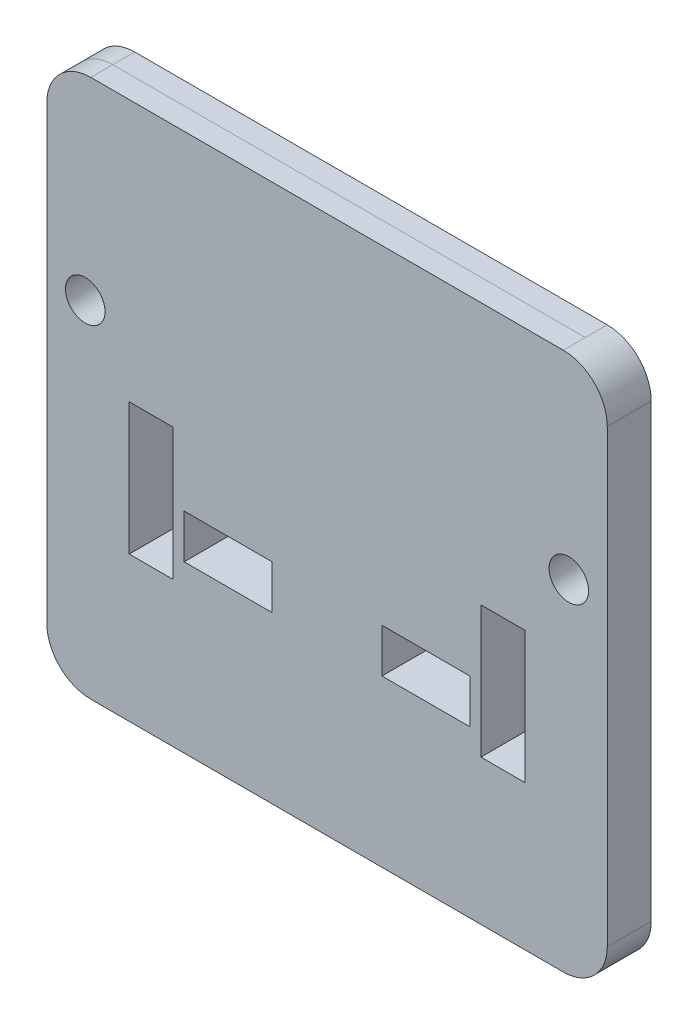
ISO-10303-21;
HEADER;
FILE_DESCRIPTION(('STEP AP214'),'2;1');
FILE_NAME('part.step','',(''),(''),'','','');
FILE_SCHEMA(('AUTOMOTIVE_DESIGN { 1 0 10303 214 1 1 1 1 }'));
ENDSEC;
DATA;
#1=APPLICATION_CONTEXT('core data for automotive mechanical design processes');
#2=APPLICATION_PROTOCOL_DEFINITION('international standard','automotive_design',2000,#1);
#3=PRODUCT_CONTEXT('',#1,'mechanical');
#4=PRODUCT('Part','Part','',(#3));
#5=PRODUCT_RELATED_PRODUCT_CATEGORY('part','',(#4));
#6=PRODUCT_DEFINITION_FORMATION('','',#4);
#7=PRODUCT_DEFINITION_CONTEXT('part definition',#1,'design');
#8=PRODUCT_DEFINITION('design','',#6,#7);
#9=PRODUCT_DEFINITION_SHAPE('','',#8);
#10=(LENGTH_UNIT() NAMED_UNIT(*) SI_UNIT(.MILLI.,.METRE.));
#11=(NAMED_UNIT(*) PLANE_ANGLE_UNIT() SI_UNIT($,.RADIAN.));
#12=(NAMED_UNIT(*) SI_UNIT($,.STERADIAN.) SOLID_ANGLE_UNIT());
#13=UNCERTAINTY_MEASURE_WITH_UNIT(LENGTH_MEASURE(1.E-05),#10,'distance_accuracy_value','');
#14=(GEOMETRIC_REPRESENTATION_CONTEXT(3) GLOBAL_UNCERTAINTY_ASSIGNED_CONTEXT((#13)) GLOBAL_UNIT_ASSIGNED_CONTEXT((#10,
#11,#12)) REPRESENTATION_CONTEXT('',''));
#15=CARTESIAN_POINT('',(0.,0.,0.));
#16=DIRECTION('',(0.,0.,1.));
#17=DIRECTION('',(1.,0.,0.));
#18=AXIS2_PLACEMENT_3D('',#15,#16,#17);
#19=CARTESIAN_POINT('',(-136.525,155.575,25.4));
#20=DIRECTION('',(0.,-1.,0.));
#21=DIRECTION('',(1.,0.,0.));
#22=AXIS2_PLACEMENT_3D('',#19,#20,#21);
#23=PLANE('',#22);
#24=DIRECTION('',(0.,0.,-1.));
#25=VECTOR('',#24,1.);
#26=CARTESIAN_POINT('',(136.525,155.575,25.4));
#27=LINE('',#26,#25);
#28=CARTESIAN_POINT('',(136.525,155.575,25.4));
#29=VERTEX_POINT('',#28);
#30=CARTESIAN_POINT('',(136.525,155.575,12.7));
#31=VERTEX_POINT('',#30);
#32=EDGE_CURVE('E416',#29,#31,#27,.T.);
#33=ORIENTED_EDGE('',*,*,#32,.T.);
#34=DIRECTION('',(-1.,0.,0.));
#35=VECTOR('',#34,1.);
#36=CARTESIAN_POINT('',(-136.525,155.575,12.7));
#37=LINE('',#36,#35);
#38=CARTESIAN_POINT('',(-136.525,155.575,12.7));
#39=VERTEX_POINT('',#38);
#40=EDGE_CURVE('E12',#31,#39,#37,.T.);
#41=ORIENTED_EDGE('',*,*,#40,.T.);
#42=DIRECTION('',(0.,0.,-1.));
#43=VECTOR('',#42,1.);
#44=CARTESIAN_POINT('',(-136.525,155.575,25.4));
#45=LINE('',#44,#43);
#46=CARTESIAN_POINT('',(-136.525,155.575,25.4));
#47=VERTEX_POINT('',#46);
#48=EDGE_CURVE('E412',#47,#39,#45,.T.);
#49=ORIENTED_EDGE('',*,*,#48,.F.);
#50=DIRECTION('',(-1.,0.,0.));
#51=VECTOR('',#50,1.);
#52=CARTESIAN_POINT('',(-136.525,155.575,25.4));
#53=LINE('',#52,#51);
#54=EDGE_CURVE('E377',#29,#47,#53,.T.);
#55=ORIENTED_EDGE('',*,*,#54,.F.);
#56=EDGE_LOOP('',(#33,#41,#49,#55));
#57=FACE_BOUND('',#56,.T.);
#58=ADVANCED_FACE('F40',(#57),#23,.F.);
#59=CARTESIAN_POINT('',(-136.525,130.175,25.4));
#60=DIRECTION('',(0.,0.,-1.));
#61=DIRECTION('',(-1.,0.,0.));
#62=AXIS2_PLACEMENT_3D('',#59,#60,#61);
#63=CYLINDRICAL_SURFACE('',#62,25.4);
#64=ORIENTED_EDGE('',*,*,#48,.T.);
#65=CARTESIAN_POINT('',(-136.525,130.175,12.7));
#66=DIRECTION('',(0.,0.,1.));
#67=DIRECTION('',(1.,0.,0.));
#68=AXIS2_PLACEMENT_3D('',#65,#66,#67);
#69=CIRCLE('',#68,25.4);
#70=CARTESIAN_POINT('',(-161.925,130.175,12.7));
#71=VERTEX_POINT('',#70);
#72=EDGE_CURVE('E48',#39,#71,#69,.T.);
#73=ORIENTED_EDGE('',*,*,#72,.T.);
#74=DIRECTION('',(0.,0.,-1.));
#75=VECTOR('',#74,1.);
#76=CARTESIAN_POINT('',(-161.925,130.175,25.4));
#77=LINE('',#76,#75);
#78=CARTESIAN_POINT('',(-161.925,130.175,25.4));
#79=VERTEX_POINT('',#78);
#80=EDGE_CURVE('E408',#79,#71,#77,.T.);
#81=ORIENTED_EDGE('',*,*,#80,.F.);
#82=CARTESIAN_POINT('',(-136.525,130.175,25.4));
#83=DIRECTION('',(0.,0.,1.));
#84=DIRECTION('',(-1.,0.,0.));
#85=AXIS2_PLACEMENT_3D('',#82,#83,#84);
#86=CIRCLE('',#85,25.4);
#87=EDGE_CURVE('E379',#47,#79,#86,.T.);
#88=ORIENTED_EDGE('',*,*,#87,.F.);
#89=EDGE_LOOP('',(#64,#73,#81,#88));
#90=FACE_BOUND('',#89,.T.);
#91=ADVANCED_FACE('F442',(#90),#63,.T.);
#92=CARTESIAN_POINT('',(-161.925,-130.175,25.4));
#93=DIRECTION('',(1.,0.,0.));
#94=DIRECTION('',(0.,0.,-1.));
#95=AXIS2_PLACEMENT_3D('',#92,#93,#94);
#96=PLANE('',#95);
#97=ORIENTED_EDGE('',*,*,#80,.T.);
#98=DIRECTION('',(0.,-1.,0.));
#99=VECTOR('',#98,1.);
#100=CARTESIAN_POINT('',(-161.925,-130.175,12.7));
#101=LINE('',#100,#99);
#102=CARTESIAN_POINT('',(-161.925,-130.175,12.7));
#103=VERTEX_POINT('',#102);
#104=EDGE_CURVE('E437',#71,#103,#101,.T.);
#105=ORIENTED_EDGE('',*,*,#104,.T.);
#106=DIRECTION('',(0.,0.,-1.));
#107=VECTOR('',#106,1.);
#108=CARTESIAN_POINT('',(-161.925,-130.175,25.4));
#109=LINE('',#108,#107);
#110=CARTESIAN_POINT('',(-161.925,-130.175,25.4));
#111=VERTEX_POINT('',#110);
#112=EDGE_CURVE('E404',#111,#103,#109,.T.);
#113=ORIENTED_EDGE('',*,*,#112,.F.);
#114=DIRECTION('',(0.,-1.,0.));
#115=VECTOR('',#114,1.);
#116=CARTESIAN_POINT('',(-161.925,-130.175,25.4));
#117=LINE('',#116,#115);
#118=EDGE_CURVE('E381',#79,#111,#117,.T.);
#119=ORIENTED_EDGE('',*,*,#118,.F.);
#120=EDGE_LOOP('',(#97,#105,#113,#119));
#121=FACE_BOUND('',#120,.T.);
#122=ADVANCED_FACE('F458',(#121),#96,.F.);
#123=CARTESIAN_POINT('',(-136.525,-130.175,25.4));
#124=DIRECTION('',(0.,0.,-1.));
#125=DIRECTION('',(-1.,0.,0.));
#126=AXIS2_PLACEMENT_3D('',#123,#124,#125);
#127=CYLINDRICAL_SURFACE('',#126,25.4);
#128=ORIENTED_EDGE('',*,*,#112,.T.);
#129=CARTESIAN_POINT('',(-136.525,-130.175,12.7));
#130=DIRECTION('',(0.,0.,1.));
#131=DIRECTION('',(1.,0.,0.));
#132=AXIS2_PLACEMENT_3D('',#129,#130,#131);
#133=CIRCLE('',#132,25.4);
#134=CARTESIAN_POINT('',(-136.525,-155.575,12.7));
#135=VERTEX_POINT('',#134);
#136=EDGE_CURVE('E435',#103,#135,#133,.T.);
#137=ORIENTED_EDGE('',*,*,#136,.T.);
#138=DIRECTION('',(0.,0.,-1.));
#139=VECTOR('',#138,1.);
#140=CARTESIAN_POINT('',(-136.525,-155.575,25.4));
#141=LINE('',#140,#139);
#142=CARTESIAN_POINT('',(-136.525,-155.575,25.4));
#143=VERTEX_POINT('',#142);
#144=EDGE_CURVE('E430',#143,#135,#141,.T.);
#145=ORIENTED_EDGE('',*,*,#144,.F.);
#146=CARTESIAN_POINT('',(-136.525,-130.175,25.4));
#147=DIRECTION('',(0.,0.,1.));
#148=DIRECTION('',(-1.,0.,0.));
#149=AXIS2_PLACEMENT_3D('',#146,#147,#148);
#150=CIRCLE('',#149,25.4);
#151=EDGE_CURVE('E365',#111,#143,#150,.T.);
#152=ORIENTED_EDGE('',*,*,#151,.F.);
#153=EDGE_LOOP('',(#128,#137,#145,#152));
#154=FACE_BOUND('',#153,.T.);
#155=ADVANCED_FACE('F486',(#154),#127,.T.);
#156=CARTESIAN_POINT('',(-136.525,-155.575,25.4));
#157=DIRECTION('',(0.,1.,0.));
#158=DIRECTION('',(0.,0.,1.));
#159=AXIS2_PLACEMENT_3D('',#156,#157,#158);
#160=PLANE('',#159);
#161=ORIENTED_EDGE('',*,*,#144,.T.);
#162=DIRECTION('',(1.,0.,0.));
#163=VECTOR('',#162,1.);
#164=CARTESIAN_POINT('',(-136.525,-155.575,12.7));
#165=LINE('',#164,#163);
#166=CARTESIAN_POINT('',(136.525,-155.575,12.7));
#167=VERTEX_POINT('',#166);
#168=EDGE_CURVE('E433',#135,#167,#165,.T.);
#169=ORIENTED_EDGE('',*,*,#168,.T.);
#170=DIRECTION('',(0.,0.,-1.));
#171=VECTOR('',#170,1.);
#172=CARTESIAN_POINT('',(136.525,-155.575,25.4));
#173=LINE('',#172,#171);
#174=CARTESIAN_POINT('',(136.525,-155.575,25.4));
#175=VERTEX_POINT('',#174);
#176=EDGE_CURVE('E426',#175,#167,#173,.T.);
#177=ORIENTED_EDGE('',*,*,#176,.F.);
#178=DIRECTION('',(1.,0.,0.));
#179=VECTOR('',#178,1.);
#180=CARTESIAN_POINT('',(-136.525,-155.575,25.4));
#181=LINE('',#180,#179);
#182=EDGE_CURVE('E368',#143,#175,#181,.T.);
#183=ORIENTED_EDGE('',*,*,#182,.F.);
#184=EDGE_LOOP('',(#161,#169,#177,#183));
#185=FACE_BOUND('',#184,.T.);
#186=ADVANCED_FACE('F492',(#185),#160,.F.);
#187=CARTESIAN_POINT('',(-136.525,-130.175,25.4));
#188=DIRECTION('',(0.,0.,-1.));
#189=DIRECTION('',(-1.,0.,0.));
#190=AXIS2_PLACEMENT_3D('',#187,#188,#189);
#191=PLANE('',#190);
#192=DIRECTION('',(0.,-1.,0.));
#193=VECTOR('',#192,1.);
#194=CARTESIAN_POINT('',(114.3,4.34574289599955,25.4));
#195=LINE('',#194,#193);
#196=CARTESIAN_POINT('',(114.3,4.34574289599955,25.4));
#197=VERTEX_POINT('',#196);
#198=CARTESIAN_POINT('',(114.3,-71.8542571040005,25.4));
#199=VERTEX_POINT('',#198);
#200=EDGE_CURVE('E230',#197,#199,#195,.T.);
#201=ORIENTED_EDGE('',*,*,#200,.T.);
#202=DIRECTION('',(-1.,0.,0.));
#203=VECTOR('',#202,1.);
#204=CARTESIAN_POINT('',(114.3,-71.8542571040005,25.4));
#205=LINE('',#204,#203);
#206=CARTESIAN_POINT('',(88.9000000000001,-71.8542571040005,25.4));
#207=VERTEX_POINT('',#206);
#208=EDGE_CURVE('E222',#199,#207,#205,.T.);
#209=ORIENTED_EDGE('',*,*,#208,.T.);
#210=DIRECTION('',(0.,1.,0.));
#211=VECTOR('',#210,1.);
#212=CARTESIAN_POINT('',(88.9000000000001,-71.8542571040005,25.4));
#213=LINE('',#212,#211);
#214=CARTESIAN_POINT('',(88.9000000000001,4.34574289599954,25.4));
#215=VERTEX_POINT('',#214);
#216=EDGE_CURVE('E233',#207,#215,#213,.T.);
#217=ORIENTED_EDGE('',*,*,#216,.T.);
#218=DIRECTION('',(1.,0.,0.));
#219=VECTOR('',#218,1.);
#220=CARTESIAN_POINT('',(88.9000000000001,4.34574289599955,25.4));
#221=LINE('',#220,#219);
#222=EDGE_CURVE('E55',#215,#197,#221,.T.);
#223=ORIENTED_EDGE('',*,*,#222,.T.);
#224=EDGE_LOOP('',(#201,#209,#217,#223));
#225=FACE_BOUND('',#224,.T.);
#226=DIRECTION('',(0.,-1.,0.));
#227=VECTOR('',#226,1.);
#228=CARTESIAN_POINT('',(-88.8999999999999,4.34574289599982,25.4));
#229=LINE('',#228,#227);
#230=CARTESIAN_POINT('',(-88.8999999999999,4.34574289599982,25.4));
#231=VERTEX_POINT('',#230);
#232=CARTESIAN_POINT('',(-88.8999999999999,-71.8542571040002,25.4));
#233=VERTEX_POINT('',#232);
#234=EDGE_CURVE('E263',#231,#233,#229,.T.);
#235=ORIENTED_EDGE('',*,*,#234,.T.);
#236=DIRECTION('',(-1.,0.,0.));
#237=VECTOR('',#236,1.);
#238=CARTESIAN_POINT('',(-88.8999999999999,-71.8542571040002,25.4));
#239=LINE('',#238,#237);
#240=CARTESIAN_POINT('',(-114.3,-71.8542571040002,25.4));
#241=VERTEX_POINT('',#240);
#242=EDGE_CURVE('E274',#233,#241,#239,.T.);
#243=ORIENTED_EDGE('',*,*,#242,.T.);
#244=DIRECTION('',(0.,1.,0.));
#245=VECTOR('',#244,1.);
#246=CARTESIAN_POINT('',(-114.3,-71.8542571040002,25.4));
#247=LINE('',#246,#245);
#248=CARTESIAN_POINT('',(-114.3,4.34574289599982,25.4));
#249=VERTEX_POINT('',#248);
#250=EDGE_CURVE('E284',#241,#249,#247,.T.);
#251=ORIENTED_EDGE('',*,*,#250,.T.);
#252=DIRECTION('',(1.,0.,0.));
#253=VECTOR('',#252,1.);
#254=CARTESIAN_POINT('',(-114.3,4.34574289599982,25.4));
#255=LINE('',#254,#253);
#256=EDGE_CURVE('E63',#249,#231,#255,.T.);
#257=ORIENTED_EDGE('',*,*,#256,.T.);
#258=EDGE_LOOP('',(#235,#243,#251,#257));
#259=FACE_BOUND('',#258,.T.);
#260=DIRECTION('',(1.,0.,0.));
#261=VECTOR('',#260,1.);
#262=CARTESIAN_POINT('',(31.7500000000001,-34.444180286,25.4));
#263=LINE('',#262,#261);
#264=CARTESIAN_POINT('',(31.7500000000001,-34.444180286,25.4));
#265=VERTEX_POINT('',#264);
#266=CARTESIAN_POINT('',(82.5500000000001,-34.444180286,25.4));
#267=VERTEX_POINT('',#266);
#268=EDGE_CURVE('E299',#265,#267,#263,.T.);
#269=ORIENTED_EDGE('',*,*,#268,.T.);
#270=DIRECTION('',(0.,-1.,0.));
#271=VECTOR('',#270,1.);
#272=CARTESIAN_POINT('',(82.5500000000001,-34.444180286,25.4));
#273=LINE('',#272,#271);
#274=CARTESIAN_POINT('',(82.5500000000001,-59.844180286,25.4));
#275=VERTEX_POINT('',#274);
#276=EDGE_CURVE('E289',#267,#275,#273,.T.);
#277=ORIENTED_EDGE('',*,*,#276,.T.);
#278=DIRECTION('',(-1.,0.,0.));
#279=VECTOR('',#278,1.);
#280=CARTESIAN_POINT('',(82.5500000000001,-59.844180286,25.4));
#281=LINE('',#280,#279);
#282=CARTESIAN_POINT('',(31.7500000000001,-59.844180286,25.4));
#283=VERTEX_POINT('',#282);
#284=EDGE_CURVE('E292',#275,#283,#281,.T.);
#285=ORIENTED_EDGE('',*,*,#284,.T.);
#286=DIRECTION('',(0.,1.,0.));
#287=VECTOR('',#286,1.);
#288=CARTESIAN_POINT('',(31.7500000000001,-59.844180286,25.4));
#289=LINE('',#288,#287);
#290=EDGE_CURVE('E296',#283,#265,#289,.T.);
#291=ORIENTED_EDGE('',*,*,#290,.T.);
#292=EDGE_LOOP('',(#269,#277,#285,#291));
#293=FACE_BOUND('',#292,.T.);
#294=DIRECTION('',(1.,0.,0.));
#295=VECTOR('',#294,1.);
#296=CARTESIAN_POINT('',(-82.5499999999999,-34.444180286,25.4));
#297=LINE('',#296,#295);
#298=CARTESIAN_POINT('',(-82.5499999999999,-34.444180286,25.4));
#299=VERTEX_POINT('',#298);
#300=CARTESIAN_POINT('',(-31.7499999999999,-34.444180286,25.4));
#301=VERTEX_POINT('',#300);
#302=EDGE_CURVE('E326',#299,#301,#297,.T.);
#303=ORIENTED_EDGE('',*,*,#302,.T.);
#304=DIRECTION('',(0.,-1.,0.));
#305=VECTOR('',#304,1.);
#306=CARTESIAN_POINT('',(-31.7499999999999,-34.444180286,25.4));
#307=LINE('',#306,#305);
#308=CARTESIAN_POINT('',(-31.7499999999999,-59.844180286,25.4));
#309=VERTEX_POINT('',#308);
#310=EDGE_CURVE('E336',#301,#309,#307,.T.);
#311=ORIENTED_EDGE('',*,*,#310,.T.);
#312=DIRECTION('',(-1.,0.,0.));
#313=VECTOR('',#312,1.);
#314=CARTESIAN_POINT('',(-31.7499999999999,-59.844180286,25.4));
#315=LINE('',#314,#313);
#316=CARTESIAN_POINT('',(-82.5499999999999,-59.844180286,25.4));
#317=VERTEX_POINT('',#316);
#318=EDGE_CURVE('E348',#309,#317,#315,.T.);
#319=ORIENTED_EDGE('',*,*,#318,.T.);
#320=DIRECTION('',(0.,1.,0.));
#321=VECTOR('',#320,1.);
#322=CARTESIAN_POINT('',(-82.5499999999999,-59.844180286,25.4));
#323=LINE('',#322,#321);
#324=EDGE_CURVE('E345',#317,#299,#323,.T.);
#325=ORIENTED_EDGE('',*,*,#324,.T.);
#326=EDGE_LOOP('',(#303,#311,#319,#325));
#327=FACE_BOUND('',#326,.T.);
#328=ORIENTED_EDGE('',*,*,#151,.T.);
#329=ORIENTED_EDGE('',*,*,#182,.T.);
#330=CARTESIAN_POINT('',(136.525,-130.175,25.4));
#331=DIRECTION('',(0.,0.,1.));
#332=DIRECTION('',(1.,0.,0.));
#333=AXIS2_PLACEMENT_3D('',#330,#331,#332);
#334=CIRCLE('',#333,25.4);
#335=CARTESIAN_POINT('',(161.925,-130.175,25.4));
#336=VERTEX_POINT('',#335);
#337=EDGE_CURVE('E371',#175,#336,#334,.T.);
#338=ORIENTED_EDGE('',*,*,#337,.T.);
#339=DIRECTION('',(0.,1.,0.));
#340=VECTOR('',#339,1.);
#341=CARTESIAN_POINT('',(161.925,-130.175,25.4));
#342=LINE('',#341,#340);
#343=CARTESIAN_POINT('',(161.925,130.175,25.4));
#344=VERTEX_POINT('',#343);
#345=EDGE_CURVE('E373',#336,#344,#342,.T.);
#346=ORIENTED_EDGE('',*,*,#345,.T.);
#347=CARTESIAN_POINT('',(136.525,130.175,25.4));
#348=DIRECTION('',(0.,0.,1.));
#349=DIRECTION('',(-1.,0.,0.));
#350=AXIS2_PLACEMENT_3D('',#347,#348,#349);
#351=CIRCLE('',#350,25.4);
#352=EDGE_CURVE('E375',#344,#29,#351,.T.);
#353=ORIENTED_EDGE('',*,*,#352,.T.);
#354=ORIENTED_EDGE('',*,*,#54,.T.);
#355=ORIENTED_EDGE('',*,*,#87,.T.);
#356=ORIENTED_EDGE('',*,*,#118,.T.);
#357=EDGE_LOOP('',(#328,#329,#338,#346,#353,#354,#355,#356));
#358=FACE_BOUND('',#357,.T.);
#359=CARTESIAN_POINT('',(-139.7,42.445742896,25.4));
#360=DIRECTION('',(0.,0.,1.));
#361=DIRECTION('',(1.,0.,0.));
#362=AXIS2_PLACEMENT_3D('',#359,#360,#361);
#363=CIRCLE('',#362,11.422);
#364=CARTESIAN_POINT('',(-128.278,42.445742896,25.4));
#365=VERTEX_POINT('',#364);
#366=EDGE_CURVE('E359',#365,#365,#363,.T.);
#367=ORIENTED_EDGE('',*,*,#366,.F.);
#368=EDGE_LOOP('',(#367));
#369=FACE_BOUND('',#368,.T.);
#370=CARTESIAN_POINT('',(139.7,42.445742896,25.4));
#371=DIRECTION('',(0.,0.,1.));
#372=DIRECTION('',(1.,0.,0.));
#373=AXIS2_PLACEMENT_3D('',#370,#371,#372);
#374=CIRCLE('',#373,11.422);
#375=CARTESIAN_POINT('',(151.122,42.445742896,25.4));
#376=VERTEX_POINT('',#375);
#377=EDGE_CURVE('E353',#376,#376,#374,.T.);
#378=ORIENTED_EDGE('',*,*,#377,.F.);
#379=EDGE_LOOP('',(#378));
#380=FACE_BOUND('',#379,.T.);
#381=ADVANCED_FACE('F237',(#225,#259,#293,#327,#358,#369,#380),#191,.F.);
#382=CARTESIAN_POINT('',(-136.525,-130.175,0.));
#383=DIRECTION('',(0.,0.,-1.));
#384=DIRECTION('',(-1.,0.,0.));
#385=AXIS2_PLACEMENT_3D('',#382,#383,#384);
#386=PLANE('',#385);
#387=DIRECTION('',(-1.,0.,0.));
#388=VECTOR('',#387,1.);
#389=CARTESIAN_POINT('',(114.3,-71.8542571040005,0.));
#390=LINE('',#389,#388);
#391=CARTESIAN_POINT('',(114.3,-71.8542571040005,0.));
#392=VERTEX_POINT('',#391);
#393=CARTESIAN_POINT('',(88.9000000000001,-71.8542571040005,0.));
#394=VERTEX_POINT('',#393);
#395=EDGE_CURVE('E225',#392,#394,#390,.T.);
#396=ORIENTED_EDGE('',*,*,#395,.F.);
#397=DIRECTION('',(0.,-1.,0.));
#398=VECTOR('',#397,1.);
#399=CARTESIAN_POINT('',(114.3,4.34574289599955,0.));
#400=LINE('',#399,#398);
#401=CARTESIAN_POINT('',(114.3,4.34574289599955,0.));
#402=VERTEX_POINT('',#401);
#403=EDGE_CURVE('E240',#402,#392,#400,.T.);
#404=ORIENTED_EDGE('',*,*,#403,.F.);
#405=DIRECTION('',(1.,0.,0.));
#406=VECTOR('',#405,1.);
#407=CARTESIAN_POINT('',(88.9000000000001,4.34574289599955,0.));
#408=LINE('',#407,#406);
#409=CARTESIAN_POINT('',(88.9000000000001,4.34574289599955,0.));
#410=VERTEX_POINT('',#409);
#411=EDGE_CURVE('E243',#410,#402,#408,.T.);
#412=ORIENTED_EDGE('',*,*,#411,.F.);
#413=DIRECTION('',(0.,1.,0.));
#414=VECTOR('',#413,1.);
#415=CARTESIAN_POINT('',(88.9000000000001,-71.8542571040005,0.));
#416=LINE('',#415,#414);
#417=EDGE_CURVE('E249',#394,#410,#416,.T.);
#418=ORIENTED_EDGE('',*,*,#417,.F.);
#419=EDGE_LOOP('',(#396,#404,#412,#418));
#420=FACE_BOUND('',#419,.T.);
#421=DIRECTION('',(-1.,0.,0.));
#422=VECTOR('',#421,1.);
#423=CARTESIAN_POINT('',(-88.8999999999999,-71.8542571040002,0.));
#424=LINE('',#423,#422);
#425=CARTESIAN_POINT('',(-88.8999999999999,-71.8542571040002,0.));
#426=VERTEX_POINT('',#425);
#427=CARTESIAN_POINT('',(-114.3,-71.8542571040002,0.));
#428=VERTEX_POINT('',#427);
#429=EDGE_CURVE('E250',#426,#428,#424,.T.);
#430=ORIENTED_EDGE('',*,*,#429,.F.);
#431=DIRECTION('',(0.,-1.,0.));
#432=VECTOR('',#431,1.);
#433=CARTESIAN_POINT('',(-88.8999999999999,4.34574289599982,0.));
#434=LINE('',#433,#432);
#435=CARTESIAN_POINT('',(-88.8999999999999,4.34574289599982,0.));
#436=VERTEX_POINT('',#435);
#437=EDGE_CURVE('E270',#436,#426,#434,.T.);
#438=ORIENTED_EDGE('',*,*,#437,.F.);
#439=DIRECTION('',(1.,0.,0.));
#440=VECTOR('',#439,1.);
#441=CARTESIAN_POINT('',(-114.3,4.34574289599982,0.));
#442=LINE('',#441,#440);
#443=CARTESIAN_POINT('',(-114.3,4.34574289599982,0.));
#444=VERTEX_POINT('',#443);
#445=EDGE_CURVE('E273',#444,#436,#442,.T.);
#446=ORIENTED_EDGE('',*,*,#445,.F.);
#447=DIRECTION('',(0.,1.,0.));
#448=VECTOR('',#447,1.);
#449=CARTESIAN_POINT('',(-114.3,-71.8542571040002,0.));
#450=LINE('',#449,#448);
#451=EDGE_CURVE('E277',#428,#444,#450,.T.);
#452=ORIENTED_EDGE('',*,*,#451,.F.);
#453=EDGE_LOOP('',(#430,#438,#446,#452));
#454=FACE_BOUND('',#453,.T.);
#455=DIRECTION('',(0.,-1.,0.));
#456=VECTOR('',#455,1.);
#457=CARTESIAN_POINT('',(82.5500000000001,-34.444180286,0.));
#458=LINE('',#457,#456);
#459=CARTESIAN_POINT('',(82.5500000000001,-34.444180286,0.));
#460=VERTEX_POINT('',#459);
#461=CARTESIAN_POINT('',(82.5500000000001,-59.844180286,0.));
#462=VERTEX_POINT('',#461);
#463=EDGE_CURVE('E303',#460,#462,#458,.T.);
#464=ORIENTED_EDGE('',*,*,#463,.F.);
#465=DIRECTION('',(1.,0.,0.));
#466=VECTOR('',#465,1.);
#467=CARTESIAN_POINT('',(31.7500000000001,-34.444180286,0.));
#468=LINE('',#467,#466);
#469=CARTESIAN_POINT('',(31.7500000000001,-34.444180286,0.));
#470=VERTEX_POINT('',#469);
#471=EDGE_CURVE('E293',#470,#460,#468,.T.);
#472=ORIENTED_EDGE('',*,*,#471,.F.);
#473=DIRECTION('',(0.,1.,0.));
#474=VECTOR('',#473,1.);
#475=CARTESIAN_POINT('',(31.7500000000001,-59.844180286,0.));
#476=LINE('',#475,#474);
#477=CARTESIAN_POINT('',(31.7500000000001,-59.844180286,0.));
#478=VERTEX_POINT('',#477);
#479=EDGE_CURVE('E309',#478,#470,#476,.T.);
#480=ORIENTED_EDGE('',*,*,#479,.F.);
#481=DIRECTION('',(-1.,0.,0.));
#482=VECTOR('',#481,1.);
#483=CARTESIAN_POINT('',(82.5500000000001,-59.844180286,0.));
#484=LINE('',#483,#482);
#485=EDGE_CURVE('E305',#462,#478,#484,.T.);
#486=ORIENTED_EDGE('',*,*,#485,.F.);
#487=EDGE_LOOP('',(#464,#472,#480,#486));
#488=FACE_BOUND('',#487,.T.);
#489=DIRECTION('',(0.,-1.,0.));
#490=VECTOR('',#489,1.);
#491=CARTESIAN_POINT('',(-31.7499999999999,-34.444180286,0.));
#492=LINE('',#491,#490);
#493=CARTESIAN_POINT('',(-31.7499999999999,-34.444180286,0.));
#494=VERTEX_POINT('',#493);
#495=CARTESIAN_POINT('',(-31.7499999999999,-59.844180286,0.));
#496=VERTEX_POINT('',#495);
#497=EDGE_CURVE('E306',#494,#496,#492,.T.);
#498=ORIENTED_EDGE('',*,*,#497,.F.);
#499=DIRECTION('',(1.,0.,0.));
#500=VECTOR('',#499,1.);
#501=CARTESIAN_POINT('',(-82.5499999999999,-34.444180286,0.));
#502=LINE('',#501,#500);
#503=CARTESIAN_POINT('',(-82.5499999999999,-34.444180286,0.));
#504=VERTEX_POINT('',#503);
#505=EDGE_CURVE('E332',#504,#494,#502,.T.);
#506=ORIENTED_EDGE('',*,*,#505,.F.);
#507=DIRECTION('',(0.,1.,0.));
#508=VECTOR('',#507,1.);
#509=CARTESIAN_POINT('',(-82.5499999999999,-59.844180286,0.));
#510=LINE('',#509,#508);
#511=CARTESIAN_POINT('',(-82.5499999999999,-59.844180286,0.));
#512=VERTEX_POINT('',#511);
#513=EDGE_CURVE('E335',#512,#504,#510,.T.);
#514=ORIENTED_EDGE('',*,*,#513,.F.);
#515=DIRECTION('',(-1.,0.,0.));
#516=VECTOR('',#515,1.);
#517=CARTESIAN_POINT('',(-31.7499999999999,-59.844180286,0.));
#518=LINE('',#517,#516);
#519=EDGE_CURVE('E339',#496,#512,#518,.T.);
#520=ORIENTED_EDGE('',*,*,#519,.F.);
#521=EDGE_LOOP('',(#498,#506,#514,#520));
#522=FACE_BOUND('',#521,.T.);
#523=CARTESIAN_POINT('',(-139.7,42.445742896,0.));
#524=DIRECTION('',(0.,0.,1.));
#525=DIRECTION('',(1.,0.,0.));
#526=AXIS2_PLACEMENT_3D('',#523,#524,#525);
#527=CIRCLE('',#526,11.422);
#528=CARTESIAN_POINT('',(-128.278,42.445742896,0.));
#529=VERTEX_POINT('',#528);
#530=EDGE_CURVE('E356',#529,#529,#527,.T.);
#531=ORIENTED_EDGE('',*,*,#530,.T.);
#532=EDGE_LOOP('',(#531));
#533=FACE_BOUND('',#532,.T.);
#534=CARTESIAN_POINT('',(-136.525,-130.175,0.));
#535=DIRECTION('',(0.,0.,1.));
#536=DIRECTION('',(-1.,0.,0.));
#537=AXIS2_PLACEMENT_3D('',#534,#535,#536);
#538=CIRCLE('',#537,25.4);
#539=CARTESIAN_POINT('',(-161.925,-130.175,0.));
#540=VERTEX_POINT('',#539);
#541=CARTESIAN_POINT('',(-136.525,-155.575,0.));
#542=VERTEX_POINT('',#541);
#543=EDGE_CURVE('E362',#540,#542,#538,.T.);
#544=ORIENTED_EDGE('',*,*,#543,.F.);
#545=DIRECTION('',(0.,-1.,0.));
#546=VECTOR('',#545,1.);
#547=CARTESIAN_POINT('',(-161.925,-130.175,0.));
#548=LINE('',#547,#546);
#549=CARTESIAN_POINT('',(-161.925,130.175,0.));
#550=VERTEX_POINT('',#549);
#551=EDGE_CURVE('E369',#550,#540,#548,.T.);
#552=ORIENTED_EDGE('',*,*,#551,.F.);
#553=CARTESIAN_POINT('',(-136.525,130.175,0.));
#554=DIRECTION('',(0.,0.,1.));
#555=DIRECTION('',(-1.,0.,0.));
#556=AXIS2_PLACEMENT_3D('',#553,#554,#555);
#557=CIRCLE('',#556,25.4);
#558=CARTESIAN_POINT('',(-136.525,155.575,0.));
#559=VERTEX_POINT('',#558);
#560=EDGE_CURVE('E399',#559,#550,#557,.T.);
#561=ORIENTED_EDGE('',*,*,#560,.F.);
#562=DIRECTION('',(-1.,0.,0.));
#563=VECTOR('',#562,1.);
#564=CARTESIAN_POINT('',(-136.525,155.575,0.));
#565=LINE('',#564,#563);
#566=CARTESIAN_POINT('',(136.525,155.575,0.));
#567=VERTEX_POINT('',#566);
#568=EDGE_CURVE('E396',#567,#559,#565,.T.);
#569=ORIENTED_EDGE('',*,*,#568,.F.);
#570=CARTESIAN_POINT('',(136.525,130.175,0.));
#571=DIRECTION('',(0.,0.,1.));
#572=DIRECTION('',(-1.,0.,0.));
#573=AXIS2_PLACEMENT_3D('',#570,#571,#572);
#574=CIRCLE('',#573,25.4);
#575=CARTESIAN_POINT('',(161.925,130.175,0.));
#576=VERTEX_POINT('',#575);
#577=EDGE_CURVE('E393',#576,#567,#574,.T.);
#578=ORIENTED_EDGE('',*,*,#577,.F.);
#579=DIRECTION('',(0.,1.,0.));
#580=VECTOR('',#579,1.);
#581=CARTESIAN_POINT('',(161.925,-130.175,0.));
#582=LINE('',#581,#580);
#583=CARTESIAN_POINT('',(161.925,-130.175,0.));
#584=VERTEX_POINT('',#583);
#585=EDGE_CURVE('E391',#584,#576,#582,.T.);
#586=ORIENTED_EDGE('',*,*,#585,.F.);
#587=CARTESIAN_POINT('',(136.525,-130.175,0.));
#588=DIRECTION('',(0.,0.,1.));
#589=DIRECTION('',(1.,0.,0.));
#590=AXIS2_PLACEMENT_3D('',#587,#588,#589);
#591=CIRCLE('',#590,25.4);
#592=CARTESIAN_POINT('',(136.525,-155.575,0.));
#593=VERTEX_POINT('',#592);
#594=EDGE_CURVE('E389',#593,#584,#591,.T.);
#595=ORIENTED_EDGE('',*,*,#594,.F.);
#596=DIRECTION('',(1.,0.,0.));
#597=VECTOR('',#596,1.);
#598=CARTESIAN_POINT('',(-136.525,-155.575,0.));
#599=LINE('',#598,#597);
#600=EDGE_CURVE('E386',#542,#593,#599,.T.);
#601=ORIENTED_EDGE('',*,*,#600,.F.);
#602=EDGE_LOOP('',(#544,#552,#561,#569,#578,#586,#595,#601));
#603=FACE_BOUND('',#602,.T.);
#604=CARTESIAN_POINT('',(139.7,42.445742896,0.));
#605=DIRECTION('',(0.,0.,1.));
#606=DIRECTION('',(1.,0.,0.));
#607=AXIS2_PLACEMENT_3D('',#604,#605,#606);
#608=CIRCLE('',#607,11.422);
#609=CARTESIAN_POINT('',(151.122,42.445742896,0.));
#610=VERTEX_POINT('',#609);
#611=EDGE_CURVE('E316',#610,#610,#608,.T.);
#612=ORIENTED_EDGE('',*,*,#611,.T.);
#613=EDGE_LOOP('',(#612));
#614=FACE_BOUND('',#613,.T.);
#615=ADVANCED_FACE('F478',(#420,#454,#488,#522,#533,#603,#614),#386,.T.);
#616=ORIENTED_EDGE('',*,*,#136,.F.);
#617=EDGE_CURVE('E383',#103,#540,#109,.T.);
#618=ORIENTED_EDGE('',*,*,#617,.T.);
#619=ORIENTED_EDGE('',*,*,#543,.T.);
#620=EDGE_CURVE('E429',#135,#542,#141,.T.);
#621=ORIENTED_EDGE('',*,*,#620,.F.);
#622=EDGE_LOOP('',(#616,#618,#619,#621));
#623=FACE_BOUND('',#622,.T.);
#624=ADVANCED_FACE('F42',(#623),#127,.T.);
#625=ORIENTED_EDGE('',*,*,#168,.F.);
#626=ORIENTED_EDGE('',*,*,#620,.T.);
#627=ORIENTED_EDGE('',*,*,#600,.T.);
#628=EDGE_CURVE('E425',#167,#593,#173,.T.);
#629=ORIENTED_EDGE('',*,*,#628,.F.);
#630=EDGE_LOOP('',(#625,#626,#627,#629));
#631=FACE_BOUND('',#630,.T.);
#632=ADVANCED_FACE('F489',(#631),#160,.F.);
#633=CARTESIAN_POINT('',(136.525,-130.175,25.4));
#634=DIRECTION('',(0.,0.,-1.));
#635=DIRECTION('',(-1.,0.,0.));
#636=AXIS2_PLACEMENT_3D('',#633,#634,#635);
#637=CYLINDRICAL_SURFACE('',#636,25.4);
#638=ORIENTED_EDGE('',*,*,#594,.T.);
#639=DIRECTION('',(0.,0.,-1.));
#640=VECTOR('',#639,1.);
#641=CARTESIAN_POINT('',(161.925,-130.175,25.4));
#642=LINE('',#641,#640);
#643=EDGE_CURVE('E422',#336,#584,#642,.T.);
#644=ORIENTED_EDGE('',*,*,#643,.F.);
#645=ORIENTED_EDGE('',*,*,#337,.F.);
#646=ORIENTED_EDGE('',*,*,#176,.T.);
#647=ORIENTED_EDGE('',*,*,#628,.T.);
#648=EDGE_LOOP('',(#638,#644,#645,#646,#647));
#649=FACE_BOUND('',#648,.T.);
#650=ADVANCED_FACE('F497',(#649),#637,.T.);
#651=CARTESIAN_POINT('',(161.925,-130.175,25.4));
#652=DIRECTION('',(-1.,0.,0.));
#653=DIRECTION('',(0.,0.,1.));
#654=AXIS2_PLACEMENT_3D('',#651,#652,#653);
#655=PLANE('',#654);
#656=ORIENTED_EDGE('',*,*,#585,.T.);
#657=DIRECTION('',(0.,0.,-1.));
#658=VECTOR('',#657,1.);
#659=CARTESIAN_POINT('',(161.925,130.175,25.4));
#660=LINE('',#659,#658);
#661=EDGE_CURVE('E419',#344,#576,#660,.T.);
#662=ORIENTED_EDGE('',*,*,#661,.F.);
#663=ORIENTED_EDGE('',*,*,#345,.F.);
#664=ORIENTED_EDGE('',*,*,#643,.T.);
#665=EDGE_LOOP('',(#656,#662,#663,#664));
#666=FACE_BOUND('',#665,.T.);
#667=ADVANCED_FACE('F499',(#666),#655,.F.);
#668=CARTESIAN_POINT('',(136.525,130.175,25.4));
#669=DIRECTION('',(0.,0.,-1.));
#670=DIRECTION('',(-1.,0.,0.));
#671=AXIS2_PLACEMENT_3D('',#668,#669,#670);
#672=CYLINDRICAL_SURFACE('',#671,25.4);
#673=ORIENTED_EDGE('',*,*,#577,.T.);
#674=EDGE_CURVE('E415',#31,#567,#27,.T.);
#675=ORIENTED_EDGE('',*,*,#674,.F.);
#676=ORIENTED_EDGE('',*,*,#32,.F.);
#677=ORIENTED_EDGE('',*,*,#352,.F.);
#678=ORIENTED_EDGE('',*,*,#661,.T.);
#679=EDGE_LOOP('',(#673,#675,#676,#677,#678));
#680=FACE_BOUND('',#679,.T.);
#681=ADVANCED_FACE('F471',(#680),#672,.T.);
#682=ORIENTED_EDGE('',*,*,#40,.F.);
#683=ORIENTED_EDGE('',*,*,#674,.T.);
#684=ORIENTED_EDGE('',*,*,#568,.T.);
#685=EDGE_CURVE('E411',#39,#559,#45,.T.);
#686=ORIENTED_EDGE('',*,*,#685,.F.);
#687=EDGE_LOOP('',(#682,#683,#684,#686));
#688=FACE_BOUND('',#687,.T.);
#689=ADVANCED_FACE('F469',(#688),#23,.F.);
#690=ORIENTED_EDGE('',*,*,#72,.F.);
#691=ORIENTED_EDGE('',*,*,#685,.T.);
#692=ORIENTED_EDGE('',*,*,#560,.T.);
#693=EDGE_CURVE('E407',#71,#550,#77,.T.);
#694=ORIENTED_EDGE('',*,*,#693,.F.);
#695=EDGE_LOOP('',(#690,#691,#692,#694));
#696=FACE_BOUND('',#695,.T.);
#697=ADVANCED_FACE('F455',(#696),#63,.T.);
#698=ORIENTED_EDGE('',*,*,#104,.F.);
#699=ORIENTED_EDGE('',*,*,#693,.T.);
#700=ORIENTED_EDGE('',*,*,#551,.T.);
#701=ORIENTED_EDGE('',*,*,#617,.F.);
#702=EDGE_LOOP('',(#698,#699,#700,#701));
#703=FACE_BOUND('',#702,.T.);
#704=ADVANCED_FACE('F451',(#703),#96,.F.);
#705=CARTESIAN_POINT('',(-139.7,42.445742896,25.4));
#706=DIRECTION('',(0.,0.,-1.));
#707=DIRECTION('',(-1.,0.,0.));
#708=AXIS2_PLACEMENT_3D('',#705,#706,#707);
#709=CYLINDRICAL_SURFACE('',#708,11.422);
#710=ORIENTED_EDGE('',*,*,#366,.T.);
#711=EDGE_LOOP('',(#710));
#712=FACE_BOUND('',#711,.T.);
#713=ORIENTED_EDGE('',*,*,#530,.F.);
#714=EDGE_LOOP('',(#713));
#715=FACE_BOUND('',#714,.T.);
#716=ADVANCED_FACE('F523',(#712,#715),#709,.F.);
#717=CARTESIAN_POINT('',(139.7,42.445742896,25.4));
#718=DIRECTION('',(0.,0.,-1.));
#719=DIRECTION('',(-1.,0.,0.));
#720=AXIS2_PLACEMENT_3D('',#717,#718,#719);
#721=CYLINDRICAL_SURFACE('',#720,11.422);
#722=ORIENTED_EDGE('',*,*,#377,.T.);
#723=EDGE_LOOP('',(#722));
#724=FACE_BOUND('',#723,.T.);
#725=ORIENTED_EDGE('',*,*,#611,.F.);
#726=EDGE_LOOP('',(#725));
#727=FACE_BOUND('',#726,.T.);
#728=ADVANCED_FACE('F532',(#724,#727),#721,.F.);
#729=CARTESIAN_POINT('',(-31.7499999999999,-34.444180286,25.4));
#730=DIRECTION('',(1.,0.,0.));
#731=DIRECTION('',(0.,0.,-1.));
#732=AXIS2_PLACEMENT_3D('',#729,#730,#731);
#733=PLANE('',#732);
#734=ORIENTED_EDGE('',*,*,#497,.T.);
#735=DIRECTION('',(0.,0.,-1.));
#736=VECTOR('',#735,1.);
#737=CARTESIAN_POINT('',(-31.7499999999999,-59.844180286,25.4));
#738=LINE('',#737,#736);
#739=EDGE_CURVE('E323',#309,#496,#738,.T.);
#740=ORIENTED_EDGE('',*,*,#739,.F.);
#741=ORIENTED_EDGE('',*,*,#310,.F.);
#742=DIRECTION('',(0.,0.,-1.));
#743=VECTOR('',#742,1.);
#744=CARTESIAN_POINT('',(-31.7499999999999,-34.444180286,25.4));
#745=LINE('',#744,#743);
#746=EDGE_CURVE('E256',#301,#494,#745,.T.);
#747=ORIENTED_EDGE('',*,*,#746,.T.);
#748=EDGE_LOOP('',(#734,#740,#741,#747));
#749=FACE_BOUND('',#748,.T.);
#750=ADVANCED_FACE('F536',(#749),#733,.F.);
#751=CARTESIAN_POINT('',(-82.5499999999999,-34.444180286,25.4));
#752=DIRECTION('',(0.,1.,0.));
#753=DIRECTION('',(0.,0.,1.));
#754=AXIS2_PLACEMENT_3D('',#751,#752,#753);
#755=PLANE('',#754);
#756=ORIENTED_EDGE('',*,*,#505,.T.);
#757=ORIENTED_EDGE('',*,*,#746,.F.);
#758=ORIENTED_EDGE('',*,*,#302,.F.);
#759=DIRECTION('',(0.,0.,-1.));
#760=VECTOR('',#759,1.);
#761=CARTESIAN_POINT('',(-82.5499999999999,-34.444180286,25.4));
#762=LINE('',#761,#760);
#763=EDGE_CURVE('E329',#299,#504,#762,.T.);
#764=ORIENTED_EDGE('',*,*,#763,.T.);
#765=EDGE_LOOP('',(#756,#757,#758,#764));
#766=FACE_BOUND('',#765,.T.);
#767=ADVANCED_FACE('F538',(#766),#755,.F.);
#768=CARTESIAN_POINT('',(-82.5499999999999,-59.844180286,25.4));
#769=DIRECTION('',(-1.,0.,0.));
#770=DIRECTION('',(0.,0.,1.));
#771=AXIS2_PLACEMENT_3D('',#768,#769,#770);
#772=PLANE('',#771);
#773=ORIENTED_EDGE('',*,*,#513,.T.);
#774=ORIENTED_EDGE('',*,*,#763,.F.);
#775=ORIENTED_EDGE('',*,*,#324,.F.);
#776=DIRECTION('',(0.,0.,-1.));
#777=VECTOR('',#776,1.);
#778=CARTESIAN_POINT('',(-82.5499999999999,-59.844180286,25.4));
#779=LINE('',#778,#777);
#780=EDGE_CURVE('E327',#317,#512,#779,.T.);
#781=ORIENTED_EDGE('',*,*,#780,.T.);
#782=EDGE_LOOP('',(#773,#774,#775,#781));
#783=FACE_BOUND('',#782,.T.);
#784=ADVANCED_FACE('F541',(#783),#772,.F.);
#785=CARTESIAN_POINT('',(-31.7499999999999,-59.844180286,25.4));
#786=DIRECTION('',(0.,-1.,0.));
#787=DIRECTION('',(0.,0.,-1.));
#788=AXIS2_PLACEMENT_3D('',#785,#786,#787);
#789=PLANE('',#788);
#790=ORIENTED_EDGE('',*,*,#519,.T.);
#791=ORIENTED_EDGE('',*,*,#780,.F.);
#792=ORIENTED_EDGE('',*,*,#318,.F.);
#793=ORIENTED_EDGE('',*,*,#739,.T.);
#794=EDGE_LOOP('',(#790,#791,#792,#793));
#795=FACE_BOUND('',#794,.T.);
#796=ADVANCED_FACE('F545',(#795),#789,.F.);
#797=CARTESIAN_POINT('',(82.5500000000001,-34.444180286,25.4));
#798=DIRECTION('',(1.,0.,0.));
#799=DIRECTION('',(0.,0.,-1.));
#800=AXIS2_PLACEMENT_3D('',#797,#798,#799);
#801=PLANE('',#800);
#802=ORIENTED_EDGE('',*,*,#463,.T.);
#803=DIRECTION('',(0.,0.,-1.));
#804=VECTOR('',#803,1.);
#805=CARTESIAN_POINT('',(82.5500000000001,-59.844180286,25.4));
#806=LINE('',#805,#804);
#807=EDGE_CURVE('E302',#275,#462,#806,.T.);
#808=ORIENTED_EDGE('',*,*,#807,.F.);
#809=ORIENTED_EDGE('',*,*,#276,.F.);
#810=DIRECTION('',(0.,0.,-1.));
#811=VECTOR('',#810,1.);
#812=CARTESIAN_POINT('',(82.5500000000001,-34.444180286,25.4));
#813=LINE('',#812,#811);
#814=EDGE_CURVE('E314',#267,#460,#813,.T.);
#815=ORIENTED_EDGE('',*,*,#814,.T.);
#816=EDGE_LOOP('',(#802,#808,#809,#815));
#817=FACE_BOUND('',#816,.T.);
#818=ADVANCED_FACE('F549',(#817),#801,.F.);
#819=CARTESIAN_POINT('',(31.7500000000001,-34.444180286,25.4));
#820=DIRECTION('',(0.,1.,0.));
#821=DIRECTION('',(0.,0.,1.));
#822=AXIS2_PLACEMENT_3D('',#819,#820,#821);
#823=PLANE('',#822);
#824=ORIENTED_EDGE('',*,*,#471,.T.);
#825=ORIENTED_EDGE('',*,*,#814,.F.);
#826=ORIENTED_EDGE('',*,*,#268,.F.);
#827=DIRECTION('',(0.,0.,-1.));
#828=VECTOR('',#827,1.);
#829=CARTESIAN_POINT('',(31.7500000000001,-34.444180286,25.4));
#830=LINE('',#829,#828);
#831=EDGE_CURVE('E317',#265,#470,#830,.T.);
#832=ORIENTED_EDGE('',*,*,#831,.T.);
#833=EDGE_LOOP('',(#824,#825,#826,#832));
#834=FACE_BOUND('',#833,.T.);
#835=ADVANCED_FACE('F556',(#834),#823,.F.);
#836=CARTESIAN_POINT('',(31.7500000000001,-59.844180286,25.4));
#837=DIRECTION('',(-1.,0.,0.));
#838=DIRECTION('',(0.,0.,1.));
#839=AXIS2_PLACEMENT_3D('',#836,#837,#838);
#840=PLANE('',#839);
#841=ORIENTED_EDGE('',*,*,#479,.T.);
#842=ORIENTED_EDGE('',*,*,#831,.F.);
#843=ORIENTED_EDGE('',*,*,#290,.F.);
#844=DIRECTION('',(0.,0.,-1.));
#845=VECTOR('',#844,1.);
#846=CARTESIAN_POINT('',(31.7500000000001,-59.844180286,25.4));
#847=LINE('',#846,#845);
#848=EDGE_CURVE('E319',#283,#478,#847,.T.);
#849=ORIENTED_EDGE('',*,*,#848,.T.);
#850=EDGE_LOOP('',(#841,#842,#843,#849));
#851=FACE_BOUND('',#850,.T.);
#852=ADVANCED_FACE('F561',(#851),#840,.F.);
#853=CARTESIAN_POINT('',(82.5500000000001,-59.844180286,25.4));
#854=DIRECTION('',(0.,-1.,0.));
#855=DIRECTION('',(0.,0.,-1.));
#856=AXIS2_PLACEMENT_3D('',#853,#854,#855);
#857=PLANE('',#856);
#858=ORIENTED_EDGE('',*,*,#485,.T.);
#859=ORIENTED_EDGE('',*,*,#848,.F.);
#860=ORIENTED_EDGE('',*,*,#284,.F.);
#861=ORIENTED_EDGE('',*,*,#807,.T.);
#862=EDGE_LOOP('',(#858,#859,#860,#861));
#863=FACE_BOUND('',#862,.T.);
#864=ADVANCED_FACE('F558',(#863),#857,.F.);
#865=CARTESIAN_POINT('',(-88.8999999999999,-71.8542571040002,25.4));
#866=DIRECTION('',(0.,-1.,0.));
#867=DIRECTION('',(0.,0.,-1.));
#868=AXIS2_PLACEMENT_3D('',#865,#866,#867);
#869=PLANE('',#868);
#870=ORIENTED_EDGE('',*,*,#429,.T.);
#871=DIRECTION('',(0.,0.,-1.));
#872=VECTOR('',#871,1.);
#873=CARTESIAN_POINT('',(-114.3,-71.8542571040002,25.4));
#874=LINE('',#873,#872);
#875=EDGE_CURVE('E260',#241,#428,#874,.T.);
#876=ORIENTED_EDGE('',*,*,#875,.F.);
#877=ORIENTED_EDGE('',*,*,#242,.F.);
#878=DIRECTION('',(0.,0.,-1.));
#879=VECTOR('',#878,1.);
#880=CARTESIAN_POINT('',(-88.8999999999999,-71.8542571040002,25.4));
#881=LINE('',#880,#879);
#882=EDGE_CURVE('E268',#233,#426,#881,.T.);
#883=ORIENTED_EDGE('',*,*,#882,.T.);
#884=EDGE_LOOP('',(#870,#876,#877,#883));
#885=FACE_BOUND('',#884,.T.);
#886=ADVANCED_FACE('F560',(#885),#869,.F.);
#887=CARTESIAN_POINT('',(-88.8999999999999,4.34574289599982,25.4));
#888=DIRECTION('',(1.,0.,0.));
#889=DIRECTION('',(0.,0.,-1.));
#890=AXIS2_PLACEMENT_3D('',#887,#888,#889);
#891=PLANE('',#890);
#892=ORIENTED_EDGE('',*,*,#437,.T.);
#893=ORIENTED_EDGE('',*,*,#882,.F.);
#894=ORIENTED_EDGE('',*,*,#234,.F.);
#895=DIRECTION('',(0.,0.,-1.));
#896=VECTOR('',#895,1.);
#897=CARTESIAN_POINT('',(-88.8999999999999,4.34574289599982,25.4));
#898=LINE('',#897,#896);
#899=EDGE_CURVE('E266',#231,#436,#898,.T.);
#900=ORIENTED_EDGE('',*,*,#899,.T.);
#901=EDGE_LOOP('',(#892,#893,#894,#900));
#902=FACE_BOUND('',#901,.T.);
#903=ADVANCED_FACE('F569',(#902),#891,.F.);
#904=CARTESIAN_POINT('',(-114.3,4.34574289599982,25.4));
#905=DIRECTION('',(0.,1.,0.));
#906=DIRECTION('',(0.,0.,1.));
#907=AXIS2_PLACEMENT_3D('',#904,#905,#906);
#908=PLANE('',#907);
#909=ORIENTED_EDGE('',*,*,#445,.T.);
#910=ORIENTED_EDGE('',*,*,#899,.F.);
#911=ORIENTED_EDGE('',*,*,#256,.F.);
#912=DIRECTION('',(0.,0.,-1.));
#913=VECTOR('',#912,1.);
#914=CARTESIAN_POINT('',(-114.3,4.34574289599982,25.4));
#915=LINE('',#914,#913);
#916=EDGE_CURVE('E264',#249,#444,#915,.T.);
#917=ORIENTED_EDGE('',*,*,#916,.T.);
#918=EDGE_LOOP('',(#909,#910,#911,#917));
#919=FACE_BOUND('',#918,.T.);
#920=ADVANCED_FACE('F572',(#919),#908,.F.);
#921=CARTESIAN_POINT('',(-114.3,-71.8542571040002,25.4));
#922=DIRECTION('',(-1.,0.,0.));
#923=DIRECTION('',(0.,0.,1.));
#924=AXIS2_PLACEMENT_3D('',#921,#922,#923);
#925=PLANE('',#924);
#926=ORIENTED_EDGE('',*,*,#451,.T.);
#927=ORIENTED_EDGE('',*,*,#916,.F.);
#928=ORIENTED_EDGE('',*,*,#250,.F.);
#929=ORIENTED_EDGE('',*,*,#875,.T.);
#930=EDGE_LOOP('',(#926,#927,#928,#929));
#931=FACE_BOUND('',#930,.T.);
#932=ADVANCED_FACE('F576',(#931),#925,.F.);
#933=CARTESIAN_POINT('',(114.3,-71.8542571040005,25.4));
#934=DIRECTION('',(0.,-1.,0.));
#935=DIRECTION('',(0.,0.,-1.));
#936=AXIS2_PLACEMENT_3D('',#933,#934,#935);
#937=PLANE('',#936);
#938=ORIENTED_EDGE('',*,*,#395,.T.);
#939=DIRECTION('',(0.,0.,-1.));
#940=VECTOR('',#939,1.);
#941=CARTESIAN_POINT('',(88.9000000000001,-71.8542571040005,25.4));
#942=LINE('',#941,#940);
#943=EDGE_CURVE('E218',#207,#394,#942,.T.);
#944=ORIENTED_EDGE('',*,*,#943,.F.);
#945=ORIENTED_EDGE('',*,*,#208,.F.);
#946=DIRECTION('',(0.,0.,-1.));
#947=VECTOR('',#946,1.);
#948=CARTESIAN_POINT('',(114.3,-71.8542571040005,25.4));
#949=LINE('',#948,#947);
#950=EDGE_CURVE('E254',#199,#392,#949,.T.);
#951=ORIENTED_EDGE('',*,*,#950,.T.);
#952=EDGE_LOOP('',(#938,#944,#945,#951));
#953=FACE_BOUND('',#952,.T.);
#954=ADVANCED_FACE('F220',(#953),#937,.F.);
#955=CARTESIAN_POINT('',(114.3,4.34574289599955,25.4));
#956=DIRECTION('',(1.,0.,0.));
#957=DIRECTION('',(0.,0.,-1.));
#958=AXIS2_PLACEMENT_3D('',#955,#956,#957);
#959=PLANE('',#958);
#960=ORIENTED_EDGE('',*,*,#403,.T.);
#961=ORIENTED_EDGE('',*,*,#950,.F.);
#962=ORIENTED_EDGE('',*,*,#200,.F.);
#963=DIRECTION('',(0.,0.,-1.));
#964=VECTOR('',#963,1.);
#965=CARTESIAN_POINT('',(114.3,4.34574289599955,25.4));
#966=LINE('',#965,#964);
#967=EDGE_CURVE('E257',#197,#402,#966,.T.);
#968=ORIENTED_EDGE('',*,*,#967,.T.);
#969=EDGE_LOOP('',(#960,#961,#962,#968));
#970=FACE_BOUND('',#969,.T.);
#971=ADVANCED_FACE('F585',(#970),#959,.F.);
#972=CARTESIAN_POINT('',(88.9000000000001,4.34574289599955,25.4));
#973=DIRECTION('',(0.,1.,0.));
#974=DIRECTION('',(0.,0.,1.));
#975=AXIS2_PLACEMENT_3D('',#972,#973,#974);
#976=PLANE('',#975);
#977=ORIENTED_EDGE('',*,*,#411,.T.);
#978=ORIENTED_EDGE('',*,*,#967,.F.);
#979=ORIENTED_EDGE('',*,*,#222,.F.);
#980=DIRECTION('',(0.,0.,-1.));
#981=VECTOR('',#980,1.);
#982=CARTESIAN_POINT('',(88.9000000000001,4.34574289599955,25.4));
#983=LINE('',#982,#981);
#984=EDGE_CURVE('E229',#215,#410,#983,.T.);
#985=ORIENTED_EDGE('',*,*,#984,.T.);
#986=EDGE_LOOP('',(#977,#978,#979,#985));
#987=FACE_BOUND('',#986,.T.);
#988=ADVANCED_FACE('F588',(#987),#976,.F.);
#989=CARTESIAN_POINT('',(88.9000000000001,-71.8542571040005,25.4));
#990=DIRECTION('',(-1.,0.,0.));
#991=DIRECTION('',(0.,0.,1.));
#992=AXIS2_PLACEMENT_3D('',#989,#990,#991);
#993=PLANE('',#992);
#994=ORIENTED_EDGE('',*,*,#417,.T.);
#995=ORIENTED_EDGE('',*,*,#984,.F.);
#996=ORIENTED_EDGE('',*,*,#216,.F.);
#997=ORIENTED_EDGE('',*,*,#943,.T.);
#998=EDGE_LOOP('',(#994,#995,#996,#997));
#999=FACE_BOUND('',#998,.T.);
#1000=ADVANCED_FACE('F234',(#999),#993,.F.);
#1001=CLOSED_SHELL('',(#58,#91,#122,#155,#186,#381,#615,#624,#632,#650,#667,#681,#689,#697,#704,
#716,#728,#750,#767,#784,#796,#818,#835,#852,#864,#886,#903,#920,#932,#954,#971,#988,#1000));
#1002=MANIFOLD_SOLID_BREP('B2',#1001);
#1003=ADVANCED_BREP_SHAPE_REPRESENTATION('',(#18,#1002),#14);
#1004=SHAPE_DEFINITION_REPRESENTATION(#9,#1003);
ENDSEC;
END-ISO-10303-21;
